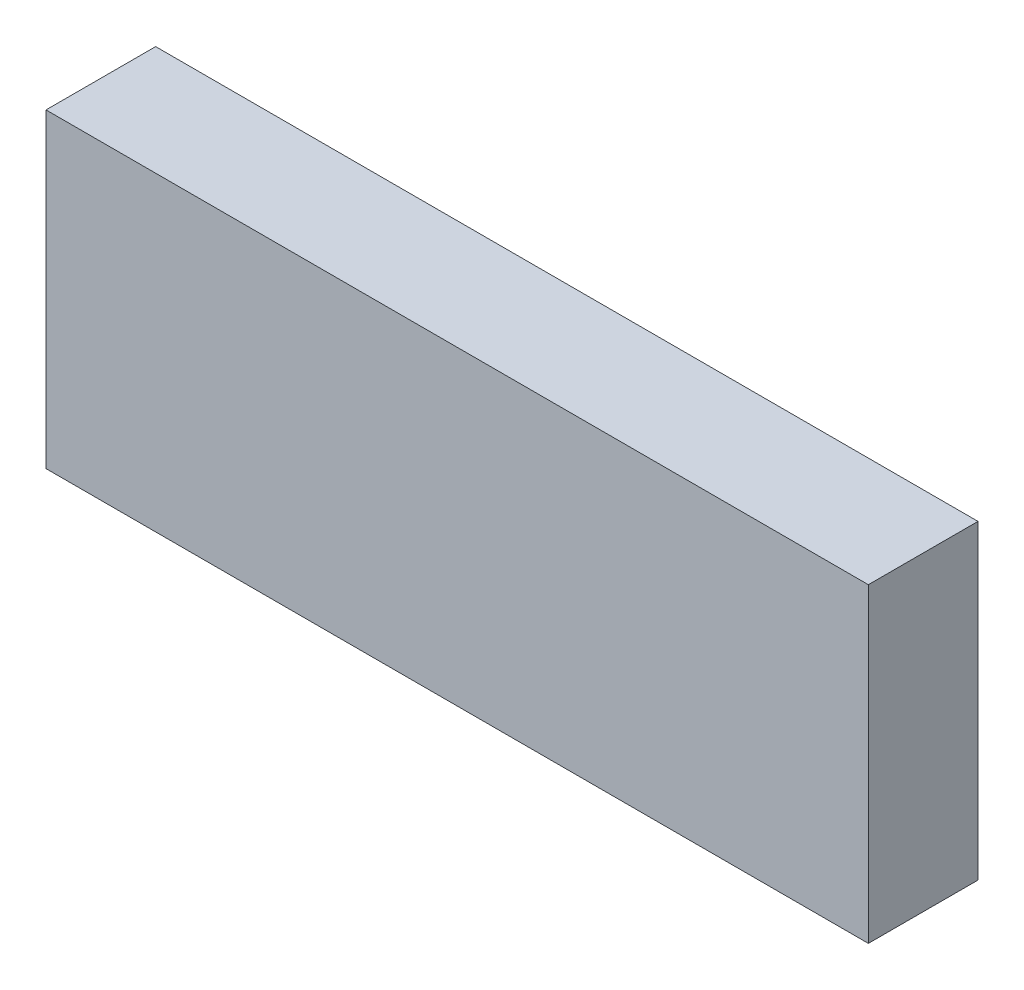
ISO-10303-21;
HEADER;
FILE_DESCRIPTION(('STEP AP214'),'2;1');
FILE_NAME('part.step','',(''),(''),'','','');
FILE_SCHEMA(('AUTOMOTIVE_DESIGN { 1 0 10303 214 1 1 1 1 }'));
ENDSEC;
DATA;
#1=APPLICATION_CONTEXT('core data for automotive mechanical design processes');
#2=APPLICATION_PROTOCOL_DEFINITION('international standard','automotive_design',2000,#1);
#3=PRODUCT_CONTEXT('',#1,'mechanical');
#4=PRODUCT('Part','Part','',(#3));
#5=PRODUCT_RELATED_PRODUCT_CATEGORY('part','',(#4));
#6=PRODUCT_DEFINITION_FORMATION('','',#4);
#7=PRODUCT_DEFINITION_CONTEXT('part definition',#1,'design');
#8=PRODUCT_DEFINITION('design','',#6,#7);
#9=PRODUCT_DEFINITION_SHAPE('','',#8);
#10=(LENGTH_UNIT() NAMED_UNIT(*) SI_UNIT(.MILLI.,.METRE.));
#11=(NAMED_UNIT(*) PLANE_ANGLE_UNIT() SI_UNIT($,.RADIAN.));
#12=(NAMED_UNIT(*) SI_UNIT($,.STERADIAN.) SOLID_ANGLE_UNIT());
#13=UNCERTAINTY_MEASURE_WITH_UNIT(LENGTH_MEASURE(1.E-05),#10,'distance_accuracy_value','');
#14=(GEOMETRIC_REPRESENTATION_CONTEXT(3) GLOBAL_UNCERTAINTY_ASSIGNED_CONTEXT((#13)) GLOBAL_UNIT_ASSIGNED_CONTEXT((#10,
#11,#12)) REPRESENTATION_CONTEXT('',''));
#15=CARTESIAN_POINT('',(0.,0.,0.));
#16=DIRECTION('',(0.,0.,1.));
#17=DIRECTION('',(1.,0.,0.));
#18=AXIS2_PLACEMENT_3D('',#15,#16,#17);
#19=CARTESIAN_POINT('',(-23.4865948383864,17.9258241758242,6.));
#20=DIRECTION('',(1.,0.,0.));
#21=DIRECTION('',(0.,0.,-1.));
#22=AXIS2_PLACEMENT_3D('',#19,#20,#21);
#23=PLANE('',#22);
#24=DIRECTION('',(0.,-1.,0.));
#25=VECTOR('',#24,1.);
#26=CARTESIAN_POINT('',(-23.4865948383864,17.9258241758242,0.));
#27=LINE('',#26,#25);
#28=CARTESIAN_POINT('',(-23.4865948383864,17.9258241758242,0.));
#29=VERTEX_POINT('',#28);
#30=CARTESIAN_POINT('',(-23.4865948383864,0.92582417582418,0.));
#31=VERTEX_POINT('',#30);
#32=EDGE_CURVE('E96',#29,#31,#27,.T.);
#33=ORIENTED_EDGE('',*,*,#32,.T.);
#34=DIRECTION('',(0.,0.,-1.));
#35=VECTOR('',#34,1.);
#36=CARTESIAN_POINT('',(-23.4865948383864,0.92582417582418,6.));
#37=LINE('',#36,#35);
#38=CARTESIAN_POINT('',(-23.4865948383864,0.92582417582418,6.));
#39=VERTEX_POINT('',#38);
#40=EDGE_CURVE('E11',#39,#31,#37,.T.);
#41=ORIENTED_EDGE('',*,*,#40,.F.);
#42=DIRECTION('',(0.,-1.,0.));
#43=VECTOR('',#42,1.);
#44=CARTESIAN_POINT('',(-23.4865948383864,17.9258241758242,6.));
#45=LINE('',#44,#43);
#46=CARTESIAN_POINT('',(-23.4865948383864,17.9258241758242,6.));
#47=VERTEX_POINT('',#46);
#48=EDGE_CURVE('E84',#47,#39,#45,.T.);
#49=ORIENTED_EDGE('',*,*,#48,.F.);
#50=DIRECTION('',(0.,0.,-1.));
#51=VECTOR('',#50,1.);
#52=CARTESIAN_POINT('',(-23.4865948383864,17.9258241758242,6.));
#53=LINE('',#52,#51);
#54=EDGE_CURVE('E92',#47,#29,#53,.T.);
#55=ORIENTED_EDGE('',*,*,#54,.T.);
#56=EDGE_LOOP('',(#33,#41,#49,#55));
#57=FACE_BOUND('',#56,.T.);
#58=ADVANCED_FACE('F33',(#57),#23,.F.);
#59=CARTESIAN_POINT('',(-23.4865948383864,0.92582417582418,6.));
#60=DIRECTION('',(0.,1.,0.));
#61=DIRECTION('',(0.,0.,1.));
#62=AXIS2_PLACEMENT_3D('',#59,#60,#61);
#63=PLANE('',#62);
#64=DIRECTION('',(1.,0.,0.));
#65=VECTOR('',#64,1.);
#66=CARTESIAN_POINT('',(-23.4865948383864,0.92582417582418,0.));
#67=LINE('',#66,#65);
#68=CARTESIAN_POINT('',(21.5134051616136,0.92582417582418,0.));
#69=VERTEX_POINT('',#68);
#70=EDGE_CURVE('E88',#31,#69,#67,.T.);
#71=ORIENTED_EDGE('',*,*,#70,.T.);
#72=DIRECTION('',(0.,0.,-1.));
#73=VECTOR('',#72,1.);
#74=CARTESIAN_POINT('',(21.5134051616136,0.92582417582418,6.));
#75=LINE('',#74,#73);
#76=CARTESIAN_POINT('',(21.5134051616136,0.92582417582418,6.));
#77=VERTEX_POINT('',#76);
#78=EDGE_CURVE('E41',#77,#69,#75,.T.);
#79=ORIENTED_EDGE('',*,*,#78,.F.);
#80=DIRECTION('',(1.,0.,0.));
#81=VECTOR('',#80,1.);
#82=CARTESIAN_POINT('',(-23.4865948383864,0.92582417582418,6.));
#83=LINE('',#82,#81);
#84=EDGE_CURVE('E79',#39,#77,#83,.T.);
#85=ORIENTED_EDGE('',*,*,#84,.F.);
#86=ORIENTED_EDGE('',*,*,#40,.T.);
#87=EDGE_LOOP('',(#71,#79,#85,#86));
#88=FACE_BOUND('',#87,.T.);
#89=ADVANCED_FACE('F87',(#88),#63,.F.);
#90=CARTESIAN_POINT('',(21.5134051616136,17.9258241758242,6.));
#91=DIRECTION('',(-1.,0.,0.));
#92=DIRECTION('',(0.,0.,1.));
#93=AXIS2_PLACEMENT_3D('',#90,#91,#92);
#94=PLANE('',#93);
#95=DIRECTION('',(0.,1.,0.));
#96=VECTOR('',#95,1.);
#97=CARTESIAN_POINT('',(21.5134051616136,17.9258241758242,0.));
#98=LINE('',#97,#96);
#99=CARTESIAN_POINT('',(21.5134051616136,17.9258241758242,0.));
#100=VERTEX_POINT('',#99);
#101=EDGE_CURVE('E66',#69,#100,#98,.T.);
#102=ORIENTED_EDGE('',*,*,#101,.T.);
#103=DIRECTION('',(0.,0.,-1.));
#104=VECTOR('',#103,1.);
#105=CARTESIAN_POINT('',(21.5134051616136,17.9258241758242,6.));
#106=LINE('',#105,#104);
#107=CARTESIAN_POINT('',(21.5134051616136,17.9258241758242,6.));
#108=VERTEX_POINT('',#107);
#109=EDGE_CURVE('E89',#108,#100,#106,.T.);
#110=ORIENTED_EDGE('',*,*,#109,.F.);
#111=DIRECTION('',(0.,1.,0.));
#112=VECTOR('',#111,1.);
#113=CARTESIAN_POINT('',(21.5134051616136,17.9258241758242,6.));
#114=LINE('',#113,#112);
#115=EDGE_CURVE('E82',#77,#108,#114,.T.);
#116=ORIENTED_EDGE('',*,*,#115,.F.);
#117=ORIENTED_EDGE('',*,*,#78,.T.);
#118=EDGE_LOOP('',(#102,#110,#116,#117));
#119=FACE_BOUND('',#118,.T.);
#120=ADVANCED_FACE('F90',(#119),#94,.F.);
#121=CARTESIAN_POINT('',(-23.4865948383864,17.9258241758242,6.));
#122=DIRECTION('',(0.,-1.,0.));
#123=DIRECTION('',(0.,0.,-1.));
#124=AXIS2_PLACEMENT_3D('',#121,#122,#123);
#125=PLANE('',#124);
#126=DIRECTION('',(-1.,0.,0.));
#127=VECTOR('',#126,1.);
#128=CARTESIAN_POINT('',(-23.4865948383864,17.9258241758242,0.));
#129=LINE('',#128,#127);
#130=EDGE_CURVE('E72',#100,#29,#129,.T.);
#131=ORIENTED_EDGE('',*,*,#130,.T.);
#132=ORIENTED_EDGE('',*,*,#54,.F.);
#133=DIRECTION('',(-1.,0.,0.));
#134=VECTOR('',#133,1.);
#135=CARTESIAN_POINT('',(-23.4865948383864,17.9258241758242,6.));
#136=LINE('',#135,#134);
#137=EDGE_CURVE('E49',#108,#47,#136,.T.);
#138=ORIENTED_EDGE('',*,*,#137,.F.);
#139=ORIENTED_EDGE('',*,*,#109,.T.);
#140=EDGE_LOOP('',(#131,#132,#138,#139));
#141=FACE_BOUND('',#140,.T.);
#142=ADVANCED_FACE('F103',(#141),#125,.F.);
#143=CARTESIAN_POINT('',(0.,0.,6.));
#144=DIRECTION('',(0.,0.,1.));
#145=DIRECTION('',(1.,0.,0.));
#146=AXIS2_PLACEMENT_3D('',#143,#144,#145);
#147=PLANE('',#146);
#148=ORIENTED_EDGE('',*,*,#48,.T.);
#149=ORIENTED_EDGE('',*,*,#84,.T.);
#150=ORIENTED_EDGE('',*,*,#115,.T.);
#151=ORIENTED_EDGE('',*,*,#137,.T.);
#152=EDGE_LOOP('',(#148,#149,#150,#151));
#153=FACE_BOUND('',#152,.T.);
#154=ADVANCED_FACE('F80',(#153),#147,.T.);
#155=CARTESIAN_POINT('',(0.,0.,0.));
#156=DIRECTION('',(0.,0.,1.));
#157=DIRECTION('',(1.,0.,0.));
#158=AXIS2_PLACEMENT_3D('',#155,#156,#157);
#159=PLANE('',#158);
#160=ORIENTED_EDGE('',*,*,#32,.F.);
#161=ORIENTED_EDGE('',*,*,#130,.F.);
#162=ORIENTED_EDGE('',*,*,#101,.F.);
#163=ORIENTED_EDGE('',*,*,#70,.F.);
#164=EDGE_LOOP('',(#160,#161,#162,#163));
#165=FACE_BOUND('',#164,.T.);
#166=ADVANCED_FACE('F106',(#165),#159,.F.);
#167=CLOSED_SHELL('',(#58,#89,#120,#142,#154,#166));
#168=MANIFOLD_SOLID_BREP('B2',#167);
#169=ADVANCED_BREP_SHAPE_REPRESENTATION('',(#18,#168),#14);
#170=SHAPE_DEFINITION_REPRESENTATION(#9,#169);
ENDSEC;
END-ISO-10303-21;
